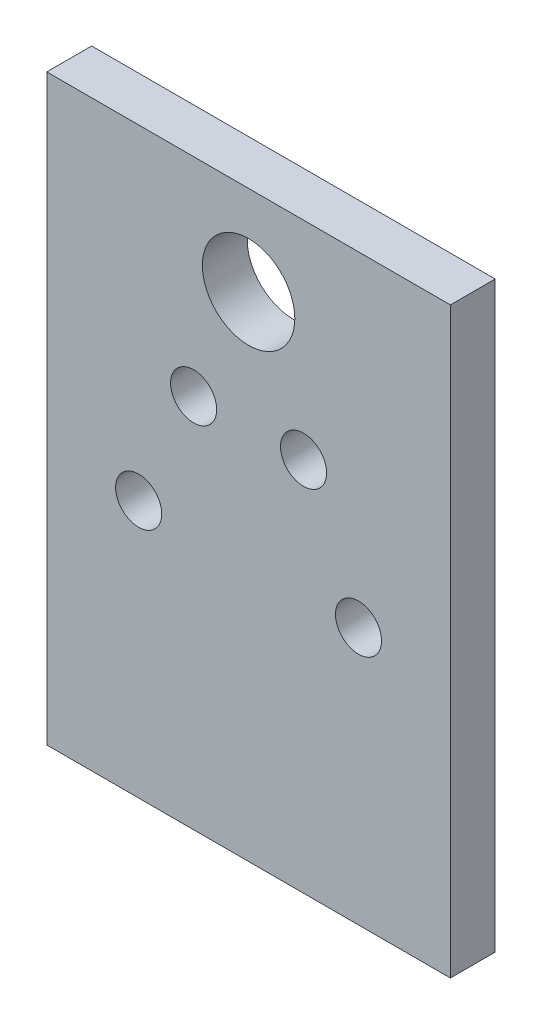
ISO-10303-21;
HEADER;
FILE_DESCRIPTION(('STEP AP214'),'2;1');
FILE_NAME('part.step','',(''),(''),'','','');
FILE_SCHEMA(('AUTOMOTIVE_DESIGN { 1 0 10303 214 1 1 1 1 }'));
ENDSEC;
DATA;
#1=APPLICATION_CONTEXT('core data for automotive mechanical design processes');
#2=APPLICATION_PROTOCOL_DEFINITION('international standard','automotive_design',2000,#1);
#3=PRODUCT_CONTEXT('',#1,'mechanical');
#4=PRODUCT('Part','Part','',(#3));
#5=PRODUCT_RELATED_PRODUCT_CATEGORY('part','',(#4));
#6=PRODUCT_DEFINITION_FORMATION('','',#4);
#7=PRODUCT_DEFINITION_CONTEXT('part definition',#1,'design');
#8=PRODUCT_DEFINITION('design','',#6,#7);
#9=PRODUCT_DEFINITION_SHAPE('','',#8);
#10=(LENGTH_UNIT() NAMED_UNIT(*) SI_UNIT(.MILLI.,.METRE.));
#11=(NAMED_UNIT(*) PLANE_ANGLE_UNIT() SI_UNIT($,.RADIAN.));
#12=(NAMED_UNIT(*) SI_UNIT($,.STERADIAN.) SOLID_ANGLE_UNIT());
#13=UNCERTAINTY_MEASURE_WITH_UNIT(LENGTH_MEASURE(1.E-05),#10,'distance_accuracy_value','');
#14=(GEOMETRIC_REPRESENTATION_CONTEXT(3) GLOBAL_UNCERTAINTY_ASSIGNED_CONTEXT((#13)) GLOBAL_UNIT_ASSIGNED_CONTEXT((#10,
#11,#12)) REPRESENTATION_CONTEXT('',''));
#15=CARTESIAN_POINT('',(0.,0.,0.));
#16=DIRECTION('',(0.,0.,1.));
#17=DIRECTION('',(1.,0.,0.));
#18=AXIS2_PLACEMENT_3D('',#15,#16,#17);
#19=CARTESIAN_POINT('',(0.,0.,6.35));
#20=DIRECTION('',(0.,0.,1.));
#21=DIRECTION('',(1.,0.,0.));
#22=AXIS2_PLACEMENT_3D('',#19,#20,#21);
#23=PLANE('',#22);
#24=CARTESIAN_POINT('',(7.78251528995487,40.46034210172,6.35));
#25=DIRECTION('',(0.,0.,1.));
#26=DIRECTION('',(-1.,0.,0.));
#27=AXIS2_PLACEMENT_3D('',#24,#25,#26);
#28=CIRCLE('',#27,3.26390000000001);
#29=CARTESIAN_POINT('',(4.51861528995486,40.46034210172,6.35));
#30=VERTEX_POINT('',#29);
#31=EDGE_CURVE('E160',#30,#30,#28,.T.);
#32=ORIENTED_EDGE('',*,*,#31,.F.);
#33=EDGE_LOOP('',(#32));
#34=FACE_BOUND('',#33,.T.);
#35=CARTESIAN_POINT('',(-7.78251528995487,40.46034210172,6.35));
#36=DIRECTION('',(0.,0.,1.));
#37=DIRECTION('',(1.,0.,0.));
#38=AXIS2_PLACEMENT_3D('',#35,#36,#37);
#39=CIRCLE('',#38,3.26390000000001);
#40=CARTESIAN_POINT('',(-4.51861528995486,40.46034210172,6.35));
#41=VERTEX_POINT('',#40);
#42=EDGE_CURVE('E172',#41,#41,#39,.T.);
#43=ORIENTED_EDGE('',*,*,#42,.F.);
#44=EDGE_LOOP('',(#43));
#45=FACE_BOUND('',#44,.T.);
#46=DIRECTION('',(0.,1.,0.));
#47=VECTOR('',#46,1.);
#48=CARTESIAN_POINT('',(28.575,12.7,6.35));
#49=LINE('',#48,#47);
#50=CARTESIAN_POINT('',(28.575,-12.7,6.35));
#51=VERTEX_POINT('',#50);
#52=CARTESIAN_POINT('',(28.575,69.85,6.35));
#53=VERTEX_POINT('',#52);
#54=EDGE_CURVE('E89',#51,#53,#49,.T.);
#55=ORIENTED_EDGE('',*,*,#54,.T.);
#56=DIRECTION('',(-1.,0.,0.));
#57=VECTOR('',#56,1.);
#58=CARTESIAN_POINT('',(-28.575,69.85,6.35));
#59=LINE('',#58,#57);
#60=CARTESIAN_POINT('',(-28.575,69.85,6.35));
#61=VERTEX_POINT('',#60);
#62=EDGE_CURVE('E92',#53,#61,#59,.T.);
#63=ORIENTED_EDGE('',*,*,#62,.T.);
#64=DIRECTION('',(0.,-1.,0.));
#65=VECTOR('',#64,1.);
#66=CARTESIAN_POINT('',(-28.575,57.15,6.35));
#67=LINE('',#66,#65);
#68=CARTESIAN_POINT('',(-28.575,-12.7,6.35));
#69=VERTEX_POINT('',#68);
#70=EDGE_CURVE('E96',#61,#69,#67,.T.);
#71=ORIENTED_EDGE('',*,*,#70,.T.);
#72=DIRECTION('',(1.,0.,0.));
#73=VECTOR('',#72,1.);
#74=CARTESIAN_POINT('',(-28.575,-12.7,6.35));
#75=LINE('',#74,#73);
#76=EDGE_CURVE('E61',#69,#51,#75,.T.);
#77=ORIENTED_EDGE('',*,*,#76,.T.);
#78=EDGE_LOOP('',(#55,#63,#71,#77));
#79=FACE_BOUND('',#78,.T.);
#80=CARTESIAN_POINT('',(0.,57.15,6.35));
#81=DIRECTION('',(0.,0.,1.));
#82=DIRECTION('',(1.,0.,0.));
#83=AXIS2_PLACEMENT_3D('',#80,#81,#82);
#84=CIRCLE('',#83,6.54812);
#85=CARTESIAN_POINT('',(6.54812,57.15,6.35));
#86=VERTEX_POINT('',#85);
#87=EDGE_CURVE('E115',#86,#86,#84,.T.);
#88=ORIENTED_EDGE('',*,*,#87,.F.);
#89=EDGE_LOOP('',(#88));
#90=FACE_BOUND('',#89,.T.);
#91=CARTESIAN_POINT('',(-15.5650305799097,23.7706842034401,6.35));
#92=DIRECTION('',(0.,0.,1.));
#93=DIRECTION('',(1.,0.,0.));
#94=AXIS2_PLACEMENT_3D('',#91,#92,#93);
#95=CIRCLE('',#94,3.26390000000003);
#96=CARTESIAN_POINT('',(-12.3011305799097,23.7706842034401,6.35));
#97=VERTEX_POINT('',#96);
#98=EDGE_CURVE('E166',#97,#97,#95,.T.);
#99=ORIENTED_EDGE('',*,*,#98,.F.);
#100=EDGE_LOOP('',(#99));
#101=FACE_BOUND('',#100,.T.);
#102=CARTESIAN_POINT('',(15.5650305799097,23.7706842034401,6.35));
#103=DIRECTION('',(0.,0.,1.));
#104=DIRECTION('',(-1.,0.,0.));
#105=AXIS2_PLACEMENT_3D('',#102,#103,#104);
#106=CIRCLE('',#105,3.2639);
#107=CARTESIAN_POINT('',(12.3011305799097,23.7706842034401,6.35));
#108=VERTEX_POINT('',#107);
#109=EDGE_CURVE('E154',#108,#108,#106,.T.);
#110=ORIENTED_EDGE('',*,*,#109,.F.);
#111=EDGE_LOOP('',(#110));
#112=FACE_BOUND('',#111,.T.);
#113=ADVANCED_FACE('F43',(#34,#45,#79,#90,#101,#112),#23,.T.);
#114=CARTESIAN_POINT('',(0.,0.,0.));
#115=DIRECTION('',(0.,0.,1.));
#116=DIRECTION('',(1.,0.,0.));
#117=AXIS2_PLACEMENT_3D('',#114,#115,#116);
#118=PLANE('',#117);
#119=DIRECTION('',(0.,1.,0.));
#120=VECTOR('',#119,1.);
#121=CARTESIAN_POINT('',(28.575,57.15,0.));
#122=LINE('',#121,#120);
#123=CARTESIAN_POINT('',(28.575,-12.7,0.));
#124=VERTEX_POINT('',#123);
#125=CARTESIAN_POINT('',(28.575,69.85,0.));
#126=VERTEX_POINT('',#125);
#127=EDGE_CURVE('E84',#124,#126,#122,.T.);
#128=ORIENTED_EDGE('',*,*,#127,.F.);
#129=DIRECTION('',(1.,0.,0.));
#130=VECTOR('',#129,1.);
#131=CARTESIAN_POINT('',(-28.575,-12.7,0.));
#132=LINE('',#131,#130);
#133=CARTESIAN_POINT('',(-28.575,-12.7,0.));
#134=VERTEX_POINT('',#133);
#135=EDGE_CURVE('E120',#134,#124,#132,.T.);
#136=ORIENTED_EDGE('',*,*,#135,.F.);
#137=DIRECTION('',(0.,-1.,0.));
#138=VECTOR('',#137,1.);
#139=CARTESIAN_POINT('',(-28.575,12.7,0.));
#140=LINE('',#139,#138);
#141=CARTESIAN_POINT('',(-28.575,69.85,0.));
#142=VERTEX_POINT('',#141);
#143=EDGE_CURVE('E77',#142,#134,#140,.T.);
#144=ORIENTED_EDGE('',*,*,#143,.F.);
#145=DIRECTION('',(-1.,0.,0.));
#146=VECTOR('',#145,1.);
#147=CARTESIAN_POINT('',(-28.575,69.85,0.));
#148=LINE('',#147,#146);
#149=EDGE_CURVE('E102',#126,#142,#148,.T.);
#150=ORIENTED_EDGE('',*,*,#149,.F.);
#151=EDGE_LOOP('',(#128,#136,#144,#150));
#152=FACE_BOUND('',#151,.T.);
#153=CARTESIAN_POINT('',(0.,57.15,0.));
#154=DIRECTION('',(0.,0.,1.));
#155=DIRECTION('',(1.,0.,0.));
#156=AXIS2_PLACEMENT_3D('',#153,#154,#155);
#157=CIRCLE('',#156,6.54812);
#158=CARTESIAN_POINT('',(6.54812,57.15,0.));
#159=VERTEX_POINT('',#158);
#160=EDGE_CURVE('E136',#159,#159,#157,.T.);
#161=ORIENTED_EDGE('',*,*,#160,.T.);
#162=EDGE_LOOP('',(#161));
#163=FACE_BOUND('',#162,.T.);
#164=CARTESIAN_POINT('',(-7.78251528995487,40.46034210172,0.));
#165=DIRECTION('',(0.,0.,1.));
#166=DIRECTION('',(1.,0.,0.));
#167=AXIS2_PLACEMENT_3D('',#164,#165,#166);
#168=CIRCLE('',#167,3.26390000000001);
#169=CARTESIAN_POINT('',(-4.51861528995486,40.46034210172,0.));
#170=VERTEX_POINT('',#169);
#171=EDGE_CURVE('E140',#170,#170,#168,.T.);
#172=ORIENTED_EDGE('',*,*,#171,.T.);
#173=EDGE_LOOP('',(#172));
#174=FACE_BOUND('',#173,.T.);
#175=CARTESIAN_POINT('',(-15.5650305799097,23.7706842034401,0.));
#176=DIRECTION('',(0.,0.,1.));
#177=DIRECTION('',(1.,0.,0.));
#178=AXIS2_PLACEMENT_3D('',#175,#176,#177);
#179=CIRCLE('',#178,3.26390000000003);
#180=CARTESIAN_POINT('',(-12.3011305799097,23.7706842034401,0.));
#181=VERTEX_POINT('',#180);
#182=EDGE_CURVE('E144',#181,#181,#179,.T.);
#183=ORIENTED_EDGE('',*,*,#182,.T.);
#184=EDGE_LOOP('',(#183));
#185=FACE_BOUND('',#184,.T.);
#186=CARTESIAN_POINT('',(7.78251528995487,40.46034210172,0.));
#187=DIRECTION('',(0.,0.,1.));
#188=DIRECTION('',(-1.,0.,0.));
#189=AXIS2_PLACEMENT_3D('',#186,#187,#188);
#190=CIRCLE('',#189,3.26390000000001);
#191=CARTESIAN_POINT('',(4.51861528995486,40.46034210172,0.));
#192=VERTEX_POINT('',#191);
#193=EDGE_CURVE('E148',#192,#192,#190,.T.);
#194=ORIENTED_EDGE('',*,*,#193,.T.);
#195=EDGE_LOOP('',(#194));
#196=FACE_BOUND('',#195,.T.);
#197=CARTESIAN_POINT('',(15.5650305799097,23.7706842034401,0.));
#198=DIRECTION('',(0.,0.,1.));
#199=DIRECTION('',(-1.,0.,0.));
#200=AXIS2_PLACEMENT_3D('',#197,#198,#199);
#201=CIRCLE('',#200,3.2639);
#202=CARTESIAN_POINT('',(12.3011305799097,23.7706842034401,0.));
#203=VERTEX_POINT('',#202);
#204=EDGE_CURVE('E151',#203,#203,#201,.T.);
#205=ORIENTED_EDGE('',*,*,#204,.T.);
#206=EDGE_LOOP('',(#205));
#207=FACE_BOUND('',#206,.T.);
#208=ADVANCED_FACE('F129',(#152,#163,#174,#185,#196,#207),#118,.F.);
#209=CARTESIAN_POINT('',(28.575,57.15,6.35));
#210=DIRECTION('',(-1.,0.,0.));
#211=DIRECTION('',(0.,0.,1.));
#212=AXIS2_PLACEMENT_3D('',#209,#210,#211);
#213=PLANE('',#212);
#214=ORIENTED_EDGE('',*,*,#127,.T.);
#215=DIRECTION('',(0.,0.,-1.));
#216=VECTOR('',#215,1.);
#217=CARTESIAN_POINT('',(28.575,69.85,6.35));
#218=LINE('',#217,#216);
#219=EDGE_CURVE('E11',#53,#126,#218,.T.);
#220=ORIENTED_EDGE('',*,*,#219,.F.);
#221=ORIENTED_EDGE('',*,*,#54,.F.);
#222=DIRECTION('',(0.,0.,-1.));
#223=VECTOR('',#222,1.);
#224=CARTESIAN_POINT('',(28.575,-12.7,6.35));
#225=LINE('',#224,#223);
#226=EDGE_CURVE('E109',#51,#124,#225,.T.);
#227=ORIENTED_EDGE('',*,*,#226,.T.);
#228=EDGE_LOOP('',(#214,#220,#221,#227));
#229=FACE_BOUND('',#228,.T.);
#230=ADVANCED_FACE('F45',(#229),#213,.F.);
#231=CARTESIAN_POINT('',(-28.575,69.85,6.35));
#232=DIRECTION('',(0.,-1.,0.));
#233=DIRECTION('',(0.,0.,-1.));
#234=AXIS2_PLACEMENT_3D('',#231,#232,#233);
#235=PLANE('',#234);
#236=ORIENTED_EDGE('',*,*,#149,.T.);
#237=DIRECTION('',(0.,0.,-1.));
#238=VECTOR('',#237,1.);
#239=CARTESIAN_POINT('',(-28.575,69.85,6.35));
#240=LINE('',#239,#238);
#241=EDGE_CURVE('E53',#61,#142,#240,.T.);
#242=ORIENTED_EDGE('',*,*,#241,.F.);
#243=ORIENTED_EDGE('',*,*,#62,.F.);
#244=ORIENTED_EDGE('',*,*,#219,.T.);
#245=EDGE_LOOP('',(#236,#242,#243,#244));
#246=FACE_BOUND('',#245,.T.);
#247=ADVANCED_FACE('F101',(#246),#235,.F.);
#248=CARTESIAN_POINT('',(-28.575,12.7,6.35));
#249=DIRECTION('',(1.,0.,0.));
#250=DIRECTION('',(0.,1.,0.));
#251=AXIS2_PLACEMENT_3D('',#248,#249,#250);
#252=PLANE('',#251);
#253=ORIENTED_EDGE('',*,*,#143,.T.);
#254=DIRECTION('',(0.,0.,-1.));
#255=VECTOR('',#254,1.);
#256=CARTESIAN_POINT('',(-28.575,-12.7,6.35));
#257=LINE('',#256,#255);
#258=EDGE_CURVE('E104',#69,#134,#257,.T.);
#259=ORIENTED_EDGE('',*,*,#258,.F.);
#260=ORIENTED_EDGE('',*,*,#70,.F.);
#261=ORIENTED_EDGE('',*,*,#241,.T.);
#262=EDGE_LOOP('',(#253,#259,#260,#261));
#263=FACE_BOUND('',#262,.T.);
#264=ADVANCED_FACE('F105',(#263),#252,.F.);
#265=CARTESIAN_POINT('',(-28.575,-12.7,6.35));
#266=DIRECTION('',(0.,1.,0.));
#267=DIRECTION('',(0.,0.,1.));
#268=AXIS2_PLACEMENT_3D('',#265,#266,#267);
#269=PLANE('',#268);
#270=ORIENTED_EDGE('',*,*,#135,.T.);
#271=ORIENTED_EDGE('',*,*,#226,.F.);
#272=ORIENTED_EDGE('',*,*,#76,.F.);
#273=ORIENTED_EDGE('',*,*,#258,.T.);
#274=EDGE_LOOP('',(#270,#271,#272,#273));
#275=FACE_BOUND('',#274,.T.);
#276=ADVANCED_FACE('F128',(#275),#269,.F.);
#277=CARTESIAN_POINT('',(0.,57.15,6.35));
#278=DIRECTION('',(0.,0.,-1.));
#279=DIRECTION('',(-1.,0.,0.));
#280=AXIS2_PLACEMENT_3D('',#277,#278,#279);
#281=CYLINDRICAL_SURFACE('',#280,6.54812);
#282=ORIENTED_EDGE('',*,*,#87,.T.);
#283=EDGE_LOOP('',(#282));
#284=FACE_BOUND('',#283,.T.);
#285=ORIENTED_EDGE('',*,*,#160,.F.);
#286=EDGE_LOOP('',(#285));
#287=FACE_BOUND('',#286,.T.);
#288=ADVANCED_FACE('F185',(#284,#287),#281,.F.);
#289=CARTESIAN_POINT('',(-7.78251528995487,40.46034210172,6.35));
#290=DIRECTION('',(0.,0.,-1.));
#291=DIRECTION('',(-1.,0.,0.));
#292=AXIS2_PLACEMENT_3D('',#289,#290,#291);
#293=CYLINDRICAL_SURFACE('',#292,3.26390000000001);
#294=ORIENTED_EDGE('',*,*,#42,.T.);
#295=EDGE_LOOP('',(#294));
#296=FACE_BOUND('',#295,.T.);
#297=ORIENTED_EDGE('',*,*,#171,.F.);
#298=EDGE_LOOP('',(#297));
#299=FACE_BOUND('',#298,.T.);
#300=ADVANCED_FACE('F208',(#296,#299),#293,.F.);
#301=CARTESIAN_POINT('',(-15.5650305799097,23.7706842034401,6.35));
#302=DIRECTION('',(0.,0.,-1.));
#303=DIRECTION('',(-1.,0.,0.));
#304=AXIS2_PLACEMENT_3D('',#301,#302,#303);
#305=CYLINDRICAL_SURFACE('',#304,3.26390000000003);
#306=ORIENTED_EDGE('',*,*,#98,.T.);
#307=EDGE_LOOP('',(#306));
#308=FACE_BOUND('',#307,.T.);
#309=ORIENTED_EDGE('',*,*,#182,.F.);
#310=EDGE_LOOP('',(#309));
#311=FACE_BOUND('',#310,.T.);
#312=ADVANCED_FACE('F202',(#308,#311),#305,.F.);
#313=CARTESIAN_POINT('',(7.78251528995487,40.46034210172,6.35));
#314=DIRECTION('',(0.,0.,-1.));
#315=DIRECTION('',(-1.,0.,0.));
#316=AXIS2_PLACEMENT_3D('',#313,#314,#315);
#317=CYLINDRICAL_SURFACE('',#316,3.26390000000001);
#318=ORIENTED_EDGE('',*,*,#31,.T.);
#319=EDGE_LOOP('',(#318));
#320=FACE_BOUND('',#319,.T.);
#321=ORIENTED_EDGE('',*,*,#193,.F.);
#322=EDGE_LOOP('',(#321));
#323=FACE_BOUND('',#322,.T.);
#324=ADVANCED_FACE('F197',(#320,#323),#317,.F.);
#325=CARTESIAN_POINT('',(15.5650305799097,23.7706842034401,6.35));
#326=DIRECTION('',(0.,0.,-1.));
#327=DIRECTION('',(-1.,0.,0.));
#328=AXIS2_PLACEMENT_3D('',#325,#326,#327);
#329=CYLINDRICAL_SURFACE('',#328,3.2639);
#330=ORIENTED_EDGE('',*,*,#109,.T.);
#331=EDGE_LOOP('',(#330));
#332=FACE_BOUND('',#331,.T.);
#333=ORIENTED_EDGE('',*,*,#204,.F.);
#334=EDGE_LOOP('',(#333));
#335=FACE_BOUND('',#334,.T.);
#336=ADVANCED_FACE('F195',(#332,#335),#329,.F.);
#337=CLOSED_SHELL('',(#113,#208,#230,#247,#264,#276,#288,#300,#312,#324,#336));
#338=MANIFOLD_SOLID_BREP('B2',#337);
#339=ADVANCED_BREP_SHAPE_REPRESENTATION('',(#18,#338),#14);
#340=SHAPE_DEFINITION_REPRESENTATION(#9,#339);
ENDSEC;
END-ISO-10303-21;
